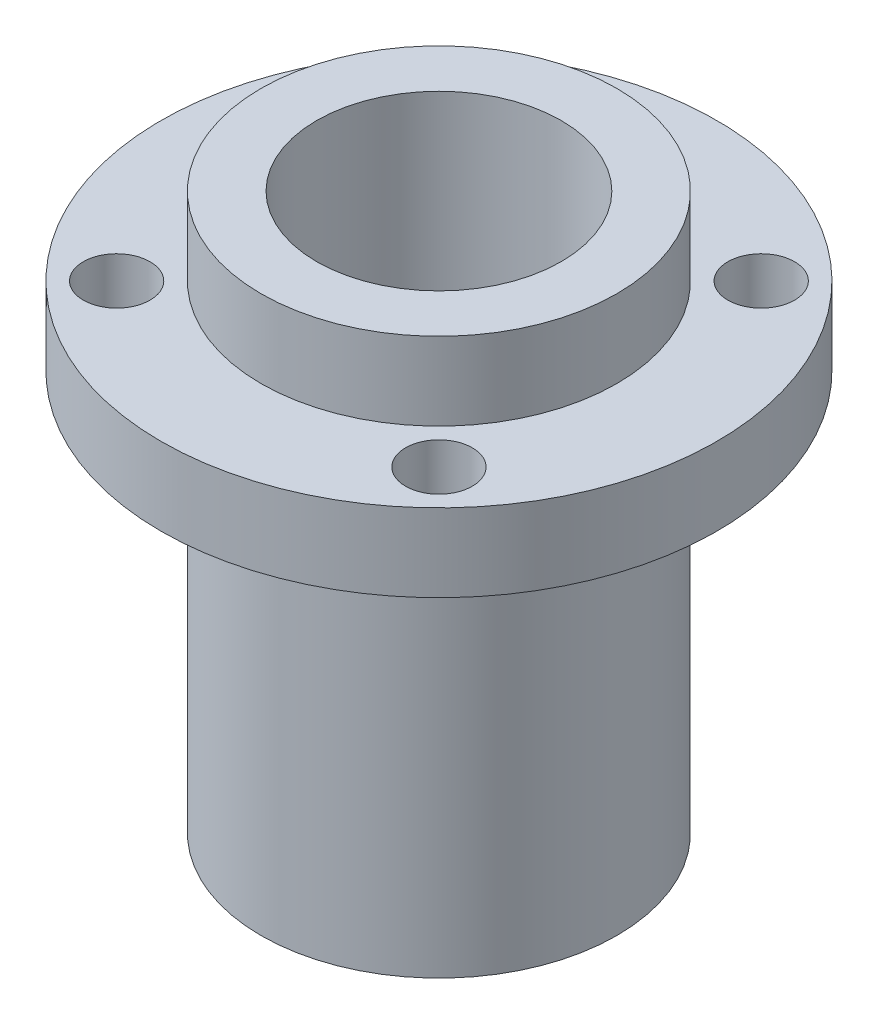
ISO-10303-21;
HEADER;
FILE_DESCRIPTION(('STEP AP214'),'2;1');
FILE_NAME('part.step','',(''),(''),'','','');
FILE_SCHEMA(('AUTOMOTIVE_DESIGN { 1 0 10303 214 1 1 1 1 }'));
ENDSEC;
DATA;
#1=APPLICATION_CONTEXT('core data for automotive mechanical design processes');
#2=APPLICATION_PROTOCOL_DEFINITION('international standard','automotive_design',2000,#1);
#3=PRODUCT_CONTEXT('',#1,'mechanical');
#4=PRODUCT('Part','Part','',(#3));
#5=PRODUCT_RELATED_PRODUCT_CATEGORY('part','',(#4));
#6=PRODUCT_DEFINITION_FORMATION('','',#4);
#7=PRODUCT_DEFINITION_CONTEXT('part definition',#1,'design');
#8=PRODUCT_DEFINITION('design','',#6,#7);
#9=PRODUCT_DEFINITION_SHAPE('','',#8);
#10=(LENGTH_UNIT() NAMED_UNIT(*) SI_UNIT(.MILLI.,.METRE.));
#11=(NAMED_UNIT(*) PLANE_ANGLE_UNIT() SI_UNIT($,.RADIAN.));
#12=(NAMED_UNIT(*) SI_UNIT($,.STERADIAN.) SOLID_ANGLE_UNIT());
#13=UNCERTAINTY_MEASURE_WITH_UNIT(LENGTH_MEASURE(1.E-05),#10,'distance_accuracy_value','');
#14=(GEOMETRIC_REPRESENTATION_CONTEXT(3) GLOBAL_UNCERTAINTY_ASSIGNED_CONTEXT((#13)) GLOBAL_UNIT_ASSIGNED_CONTEXT((#10,
#11,#12)) REPRESENTATION_CONTEXT('',''));
#15=CARTESIAN_POINT('',(0.,0.,0.));
#16=DIRECTION('',(0.,0.,1.));
#17=DIRECTION('',(1.,0.,0.));
#18=AXIS2_PLACEMENT_3D('',#15,#16,#17);
#19=CARTESIAN_POINT('',(0.,3.5,0.));
#20=DIRECTION('',(0.,-1.,0.));
#21=DIRECTION('',(0.,0.,-1.));
#22=AXIS2_PLACEMENT_3D('',#19,#20,#21);
#23=CYLINDRICAL_SURFACE('',#22,12.5);
#24=CARTESIAN_POINT('',(0.,3.5,0.));
#25=DIRECTION('',(0.,1.,0.));
#26=DIRECTION('',(0.,0.,1.));
#27=AXIS2_PLACEMENT_3D('',#24,#25,#26);
#28=CIRCLE('',#27,12.5);
#29=CARTESIAN_POINT('',(0.,3.5,12.5));
#30=VERTEX_POINT('',#29);
#31=EDGE_CURVE('E48',#30,#30,#28,.T.);
#32=ORIENTED_EDGE('',*,*,#31,.F.);
#33=EDGE_LOOP('',(#32));
#34=FACE_BOUND('',#33,.T.);
#35=CARTESIAN_POINT('',(0.,0.,0.));
#36=DIRECTION('',(0.,1.,0.));
#37=DIRECTION('',(0.,0.,1.));
#38=AXIS2_PLACEMENT_3D('',#35,#36,#37);
#39=CIRCLE('',#38,12.5);
#40=CARTESIAN_POINT('',(0.,0.,12.5));
#41=VERTEX_POINT('',#40);
#42=EDGE_CURVE('E53',#41,#41,#39,.T.);
#43=ORIENTED_EDGE('',*,*,#42,.T.);
#44=EDGE_LOOP('',(#43));
#45=FACE_BOUND('',#44,.T.);
#46=ADVANCED_FACE('F41',(#34,#45),#23,.T.);
#47=CARTESIAN_POINT('',(0.,3.5,0.));
#48=DIRECTION('',(0.,1.,0.));
#49=DIRECTION('',(0.,0.,1.));
#50=AXIS2_PLACEMENT_3D('',#47,#48,#49);
#51=PLANE('',#50);
#52=CARTESIAN_POINT('',(-7.2478445071621,3.5,7.24784450716213));
#53=DIRECTION('',(0.,1.,0.));
#54=DIRECTION('',(0.,0.,1.));
#55=AXIS2_PLACEMENT_3D('',#52,#53,#54);
#56=CIRCLE('',#55,1.5);
#57=CARTESIAN_POINT('',(-7.2478445071621,3.5,8.74784450716213));
#58=VERTEX_POINT('',#57);
#59=EDGE_CURVE('E85',#58,#58,#56,.F.);
#60=ORIENTED_EDGE('',*,*,#59,.T.);
#61=EDGE_LOOP('',(#60));
#62=FACE_BOUND('',#61,.T.);
#63=CARTESIAN_POINT('',(7.24784450716213,3.5,7.2478445071621));
#64=DIRECTION('',(0.,1.,0.));
#65=DIRECTION('',(0.,0.,1.));
#66=AXIS2_PLACEMENT_3D('',#63,#64,#65);
#67=CIRCLE('',#66,1.5);
#68=CARTESIAN_POINT('',(7.24784450716213,3.5,8.7478445071621));
#69=VERTEX_POINT('',#68);
#70=EDGE_CURVE('E92',#69,#69,#67,.F.);
#71=ORIENTED_EDGE('',*,*,#70,.T.);
#72=EDGE_LOOP('',(#71));
#73=FACE_BOUND('',#72,.T.);
#74=CARTESIAN_POINT('',(7.2478445071621,3.5,-7.24784450716213));
#75=DIRECTION('',(0.,1.,0.));
#76=DIRECTION('',(0.,0.,1.));
#77=AXIS2_PLACEMENT_3D('',#74,#75,#76);
#78=CIRCLE('',#77,1.5);
#79=CARTESIAN_POINT('',(7.2478445071621,3.5,-5.74784450716213));
#80=VERTEX_POINT('',#79);
#81=EDGE_CURVE('E96',#80,#80,#78,.F.);
#82=ORIENTED_EDGE('',*,*,#81,.T.);
#83=EDGE_LOOP('',(#82));
#84=FACE_BOUND('',#83,.T.);
#85=CARTESIAN_POINT('',(-7.24784450716213,3.5,-7.2478445071621));
#86=DIRECTION('',(0.,1.,0.));
#87=DIRECTION('',(0.,0.,1.));
#88=AXIS2_PLACEMENT_3D('',#85,#86,#87);
#89=CIRCLE('',#88,1.5);
#90=CARTESIAN_POINT('',(-7.24784450716213,3.5,-5.7478445071621));
#91=VERTEX_POINT('',#90);
#92=EDGE_CURVE('E100',#91,#91,#89,.F.);
#93=ORIENTED_EDGE('',*,*,#92,.T.);
#94=EDGE_LOOP('',(#93));
#95=FACE_BOUND('',#94,.T.);
#96=CARTESIAN_POINT('',(0.,3.5,0.));
#97=DIRECTION('',(0.,1.,0.));
#98=DIRECTION('',(0.,0.,1.));
#99=AXIS2_PLACEMENT_3D('',#96,#97,#98);
#100=CIRCLE('',#99,8.);
#101=CARTESIAN_POINT('',(0.,3.5,8.));
#102=VERTEX_POINT('',#101);
#103=EDGE_CURVE('E61',#102,#102,#100,.T.);
#104=ORIENTED_EDGE('',*,*,#103,.F.);
#105=EDGE_LOOP('',(#104));
#106=FACE_BOUND('',#105,.T.);
#107=ORIENTED_EDGE('',*,*,#31,.T.);
#108=EDGE_LOOP('',(#107));
#109=FACE_BOUND('',#108,.T.);
#110=ADVANCED_FACE('F142',(#62,#73,#84,#95,#106,#109),#51,.T.);
#111=CARTESIAN_POINT('',(0.,0.,0.));
#112=DIRECTION('',(0.,1.,0.));
#113=DIRECTION('',(0.,0.,1.));
#114=AXIS2_PLACEMENT_3D('',#111,#112,#113);
#115=PLANE('',#114);
#116=CARTESIAN_POINT('',(-7.2478445071621,0.,7.24784450716213));
#117=DIRECTION('',(0.,1.,0.));
#118=DIRECTION('',(0.,0.,1.));
#119=AXIS2_PLACEMENT_3D('',#116,#117,#118);
#120=CIRCLE('',#119,1.5);
#121=CARTESIAN_POINT('',(-7.2478445071621,0.,8.74784450716213));
#122=VERTEX_POINT('',#121);
#123=EDGE_CURVE('E109',#122,#122,#120,.T.);
#124=ORIENTED_EDGE('',*,*,#123,.T.);
#125=EDGE_LOOP('',(#124));
#126=FACE_BOUND('',#125,.T.);
#127=CARTESIAN_POINT('',(7.24784450716213,0.,7.2478445071621));
#128=DIRECTION('',(0.,1.,0.));
#129=DIRECTION('',(0.,0.,1.));
#130=AXIS2_PLACEMENT_3D('',#127,#128,#129);
#131=CIRCLE('',#130,1.5);
#132=CARTESIAN_POINT('',(7.24784450716213,0.,8.7478445071621));
#133=VERTEX_POINT('',#132);
#134=EDGE_CURVE('E113',#133,#133,#131,.T.);
#135=ORIENTED_EDGE('',*,*,#134,.T.);
#136=EDGE_LOOP('',(#135));
#137=FACE_BOUND('',#136,.T.);
#138=CARTESIAN_POINT('',(7.2478445071621,0.,-7.24784450716213));
#139=DIRECTION('',(0.,1.,0.));
#140=DIRECTION('',(0.,0.,1.));
#141=AXIS2_PLACEMENT_3D('',#138,#139,#140);
#142=CIRCLE('',#141,1.5);
#143=CARTESIAN_POINT('',(7.2478445071621,0.,-5.74784450716213));
#144=VERTEX_POINT('',#143);
#145=EDGE_CURVE('E108',#144,#144,#142,.T.);
#146=ORIENTED_EDGE('',*,*,#145,.T.);
#147=EDGE_LOOP('',(#146));
#148=FACE_BOUND('',#147,.T.);
#149=CARTESIAN_POINT('',(-7.24784450716213,0.,-7.2478445071621));
#150=DIRECTION('',(0.,1.,0.));
#151=DIRECTION('',(0.,0.,1.));
#152=AXIS2_PLACEMENT_3D('',#149,#150,#151);
#153=CIRCLE('',#152,1.5);
#154=CARTESIAN_POINT('',(-7.24784450716213,0.,-5.7478445071621));
#155=VERTEX_POINT('',#154);
#156=EDGE_CURVE('E104',#155,#155,#153,.T.);
#157=ORIENTED_EDGE('',*,*,#156,.T.);
#158=EDGE_LOOP('',(#157));
#159=FACE_BOUND('',#158,.T.);
#160=CARTESIAN_POINT('',(0.,0.,0.));
#161=DIRECTION('',(0.,1.,0.));
#162=DIRECTION('',(0.,0.,1.));
#163=AXIS2_PLACEMENT_3D('',#160,#161,#162);
#164=CIRCLE('',#163,8.);
#165=CARTESIAN_POINT('',(0.,0.,8.));
#166=VERTEX_POINT('',#165);
#167=EDGE_CURVE('E73',#166,#166,#164,.T.);
#168=ORIENTED_EDGE('',*,*,#167,.T.);
#169=EDGE_LOOP('',(#168));
#170=FACE_BOUND('',#169,.T.);
#171=ORIENTED_EDGE('',*,*,#42,.F.);
#172=EDGE_LOOP('',(#171));
#173=FACE_BOUND('',#172,.T.);
#174=ADVANCED_FACE('F121',(#126,#137,#148,#159,#170,#173),#115,.F.);
#175=CARTESIAN_POINT('',(0.,7.,0.));
#176=DIRECTION('',(0.,1.,0.));
#177=DIRECTION('',(0.,0.,1.));
#178=AXIS2_PLACEMENT_3D('',#175,#176,#177);
#179=PLANE('',#178);
#180=CARTESIAN_POINT('',(0.,7.,0.));
#181=DIRECTION('',(0.,1.,0.));
#182=DIRECTION('',(0.,0.,1.));
#183=AXIS2_PLACEMENT_3D('',#180,#181,#182);
#184=CIRCLE('',#183,8.);
#185=CARTESIAN_POINT('',(0.,7.,8.));
#186=VERTEX_POINT('',#185);
#187=EDGE_CURVE('E59',#186,#186,#184,.T.);
#188=ORIENTED_EDGE('',*,*,#187,.T.);
#189=EDGE_LOOP('',(#188));
#190=FACE_BOUND('',#189,.T.);
#191=CARTESIAN_POINT('',(0.,7.,0.));
#192=DIRECTION('',(0.,1.,0.));
#193=DIRECTION('',(0.,0.,1.));
#194=AXIS2_PLACEMENT_3D('',#191,#192,#193);
#195=CIRCLE('',#194,5.5);
#196=CARTESIAN_POINT('',(0.,7.,5.5));
#197=VERTEX_POINT('',#196);
#198=EDGE_CURVE('E65',#197,#197,#195,.T.);
#199=ORIENTED_EDGE('',*,*,#198,.F.);
#200=EDGE_LOOP('',(#199));
#201=FACE_BOUND('',#200,.T.);
#202=ADVANCED_FACE('F153',(#190,#201),#179,.T.);
#203=CARTESIAN_POINT('',(0.,7.,0.));
#204=DIRECTION('',(0.,-1.,0.));
#205=DIRECTION('',(0.,0.,-1.));
#206=AXIS2_PLACEMENT_3D('',#203,#204,#205);
#207=CYLINDRICAL_SURFACE('',#206,8.);
#208=ORIENTED_EDGE('',*,*,#187,.F.);
#209=EDGE_LOOP('',(#208));
#210=FACE_BOUND('',#209,.T.);
#211=ORIENTED_EDGE('',*,*,#103,.T.);
#212=EDGE_LOOP('',(#211));
#213=FACE_BOUND('',#212,.T.);
#214=ADVANCED_FACE('F158',(#210,#213),#207,.T.);
#215=CARTESIAN_POINT('',(0.,7.,0.));
#216=DIRECTION('',(0.,-1.,0.));
#217=DIRECTION('',(0.,0.,-1.));
#218=AXIS2_PLACEMENT_3D('',#215,#216,#217);
#219=CYLINDRICAL_SURFACE('',#218,5.5);
#220=CARTESIAN_POINT('',(0.,-15.5,0.));
#221=DIRECTION('',(0.,1.,0.));
#222=DIRECTION('',(0.,0.,1.));
#223=AXIS2_PLACEMENT_3D('',#220,#221,#222);
#224=CIRCLE('',#223,5.5);
#225=CARTESIAN_POINT('',(0.,-15.5,5.5));
#226=VERTEX_POINT('',#225);
#227=EDGE_CURVE('E10',#226,#226,#224,.T.);
#228=ORIENTED_EDGE('',*,*,#227,.F.);
#229=EDGE_LOOP('',(#228));
#230=FACE_BOUND('',#229,.T.);
#231=ORIENTED_EDGE('',*,*,#198,.T.);
#232=EDGE_LOOP('',(#231));
#233=FACE_BOUND('',#232,.T.);
#234=ADVANCED_FACE('F164',(#230,#233),#219,.F.);
#235=CARTESIAN_POINT('',(0.,-18.,0.));
#236=DIRECTION('',(0.,1.,0.));
#237=DIRECTION('',(0.,0.,1.));
#238=AXIS2_PLACEMENT_3D('',#235,#236,#237);
#239=CYLINDRICAL_SURFACE('',#238,8.);
#240=CARTESIAN_POINT('',(0.,-18.,0.));
#241=DIRECTION('',(0.,1.,0.));
#242=DIRECTION('',(0.,0.,1.));
#243=AXIS2_PLACEMENT_3D('',#240,#241,#242);
#244=CIRCLE('',#243,8.);
#245=CARTESIAN_POINT('',(0.,-18.,8.));
#246=VERTEX_POINT('',#245);
#247=EDGE_CURVE('E72',#246,#246,#244,.T.);
#248=ORIENTED_EDGE('',*,*,#247,.T.);
#249=EDGE_LOOP('',(#248));
#250=FACE_BOUND('',#249,.T.);
#251=ORIENTED_EDGE('',*,*,#167,.F.);
#252=EDGE_LOOP('',(#251));
#253=FACE_BOUND('',#252,.T.);
#254=ADVANCED_FACE('F169',(#250,#253),#239,.T.);
#255=CARTESIAN_POINT('',(0.,-18.,0.));
#256=DIRECTION('',(0.,1.,0.));
#257=DIRECTION('',(0.,0.,1.));
#258=AXIS2_PLACEMENT_3D('',#255,#256,#257);
#259=PLANE('',#258);
#260=ORIENTED_EDGE('',*,*,#247,.F.);
#261=EDGE_LOOP('',(#260));
#262=FACE_BOUND('',#261,.T.);
#263=CARTESIAN_POINT('',(0.,-18.,0.));
#264=DIRECTION('',(0.,1.,0.));
#265=DIRECTION('',(0.,0.,1.));
#266=AXIS2_PLACEMENT_3D('',#263,#264,#265);
#267=CIRCLE('',#266,2.05);
#268=CARTESIAN_POINT('',(0.,-18.,2.05));
#269=VERTEX_POINT('',#268);
#270=EDGE_CURVE('E81',#269,#269,#267,.T.);
#271=ORIENTED_EDGE('',*,*,#270,.T.);
#272=EDGE_LOOP('',(#271));
#273=FACE_BOUND('',#272,.T.);
#274=ADVANCED_FACE('F173',(#262,#273),#259,.F.);
#275=CARTESIAN_POINT('',(0.,-15.5,0.));
#276=DIRECTION('',(0.,1.,0.));
#277=DIRECTION('',(0.,0.,1.));
#278=AXIS2_PLACEMENT_3D('',#275,#276,#277);
#279=PLANE('',#278);
#280=ORIENTED_EDGE('',*,*,#227,.T.);
#281=EDGE_LOOP('',(#280));
#282=FACE_BOUND('',#281,.T.);
#283=CARTESIAN_POINT('',(0.,-15.5,0.));
#284=DIRECTION('',(0.,1.,0.));
#285=DIRECTION('',(0.,0.,1.));
#286=AXIS2_PLACEMENT_3D('',#283,#284,#285);
#287=CIRCLE('',#286,2.05);
#288=CARTESIAN_POINT('',(0.,-15.5,2.05));
#289=VERTEX_POINT('',#288);
#290=EDGE_CURVE('E77',#289,#289,#287,.T.);
#291=ORIENTED_EDGE('',*,*,#290,.F.);
#292=EDGE_LOOP('',(#291));
#293=FACE_BOUND('',#292,.T.);
#294=ADVANCED_FACE('F177',(#282,#293),#279,.T.);
#295=CARTESIAN_POINT('',(0.,-15.5,0.));
#296=DIRECTION('',(0.,-1.,0.));
#297=DIRECTION('',(0.,0.,-1.));
#298=AXIS2_PLACEMENT_3D('',#295,#296,#297);
#299=CYLINDRICAL_SURFACE('',#298,2.05);
#300=ORIENTED_EDGE('',*,*,#290,.T.);
#301=EDGE_LOOP('',(#300));
#302=FACE_BOUND('',#301,.T.);
#303=ORIENTED_EDGE('',*,*,#270,.F.);
#304=EDGE_LOOP('',(#303));
#305=FACE_BOUND('',#304,.T.);
#306=ADVANCED_FACE('F137',(#302,#305),#299,.F.);
#307=CARTESIAN_POINT('',(-7.24784450716213,7.,-7.2478445071621));
#308=DIRECTION('',(0.,-1.,0.));
#309=DIRECTION('',(0.,0.,-1.));
#310=AXIS2_PLACEMENT_3D('',#307,#308,#309);
#311=CYLINDRICAL_SURFACE('',#310,1.5);
#312=ORIENTED_EDGE('',*,*,#92,.F.);
#313=EDGE_LOOP('',(#312));
#314=FACE_BOUND('',#313,.T.);
#315=ORIENTED_EDGE('',*,*,#156,.F.);
#316=EDGE_LOOP('',(#315));
#317=FACE_BOUND('',#316,.T.);
#318=ADVANCED_FACE('F127',(#314,#317),#311,.F.);
#319=CARTESIAN_POINT('',(7.2478445071621,7.,-7.24784450716213));
#320=DIRECTION('',(0.,-1.,0.));
#321=DIRECTION('',(0.,0.,-1.));
#322=AXIS2_PLACEMENT_3D('',#319,#320,#321);
#323=CYLINDRICAL_SURFACE('',#322,1.5);
#324=ORIENTED_EDGE('',*,*,#81,.F.);
#325=EDGE_LOOP('',(#324));
#326=FACE_BOUND('',#325,.T.);
#327=ORIENTED_EDGE('',*,*,#145,.F.);
#328=EDGE_LOOP('',(#327));
#329=FACE_BOUND('',#328,.T.);
#330=ADVANCED_FACE('F124',(#326,#329),#323,.F.);
#331=CARTESIAN_POINT('',(7.24784450716213,7.,7.2478445071621));
#332=DIRECTION('',(0.,-1.,0.));
#333=DIRECTION('',(0.,0.,-1.));
#334=AXIS2_PLACEMENT_3D('',#331,#332,#333);
#335=CYLINDRICAL_SURFACE('',#334,1.5);
#336=ORIENTED_EDGE('',*,*,#70,.F.);
#337=EDGE_LOOP('',(#336));
#338=FACE_BOUND('',#337,.T.);
#339=ORIENTED_EDGE('',*,*,#134,.F.);
#340=EDGE_LOOP('',(#339));
#341=FACE_BOUND('',#340,.T.);
#342=ADVANCED_FACE('F126',(#338,#341),#335,.F.);
#343=CARTESIAN_POINT('',(-7.2478445071621,7.,7.24784450716213));
#344=DIRECTION('',(0.,-1.,0.));
#345=DIRECTION('',(0.,0.,-1.));
#346=AXIS2_PLACEMENT_3D('',#343,#344,#345);
#347=CYLINDRICAL_SURFACE('',#346,1.5);
#348=ORIENTED_EDGE('',*,*,#59,.F.);
#349=EDGE_LOOP('',(#348));
#350=FACE_BOUND('',#349,.T.);
#351=ORIENTED_EDGE('',*,*,#123,.F.);
#352=EDGE_LOOP('',(#351));
#353=FACE_BOUND('',#352,.T.);
#354=ADVANCED_FACE('F134',(#350,#353),#347,.F.);
#355=CLOSED_SHELL('',(#46,#110,#174,#202,#214,#234,#254,#274,#294,#306,#318,#330,#342,#354));
#356=MANIFOLD_SOLID_BREP('B2',#355);
#357=ADVANCED_BREP_SHAPE_REPRESENTATION('',(#18,#356),#14);
#358=SHAPE_DEFINITION_REPRESENTATION(#9,#357);
ENDSEC;
END-ISO-10303-21;
